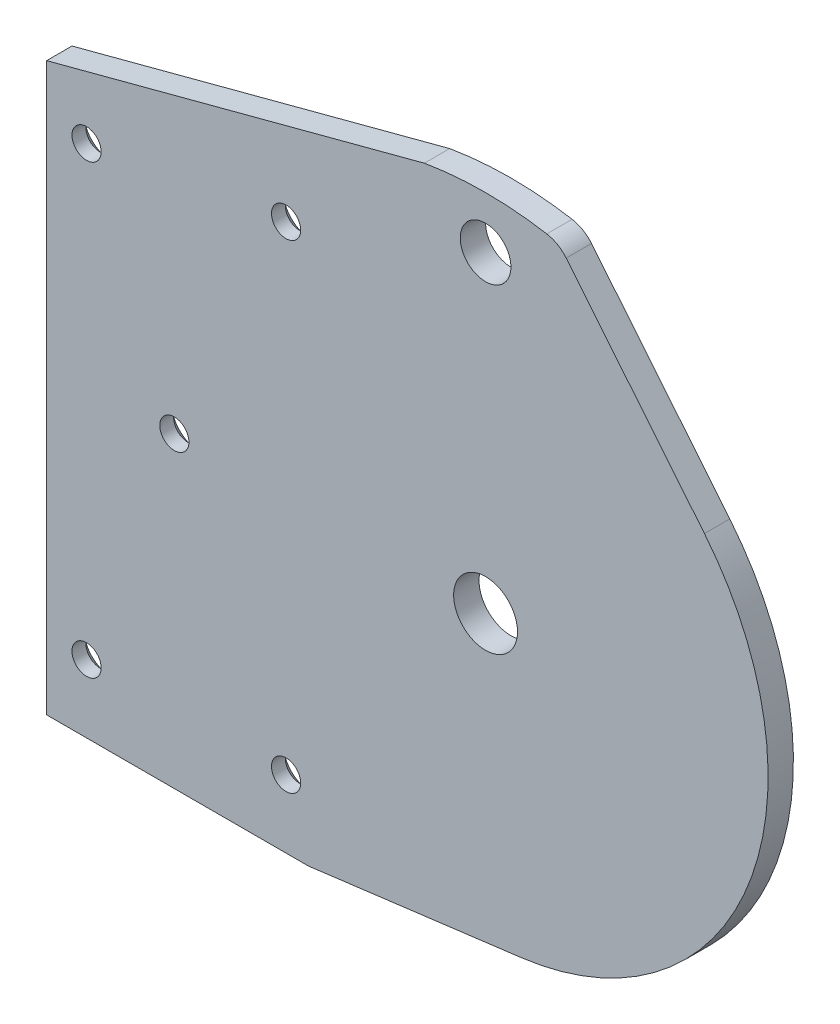
ISO-10303-21;
HEADER;
FILE_DESCRIPTION(('STEP AP214'),'2;1');
FILE_NAME('part.step','',(''),(''),'','','');
FILE_SCHEMA(('AUTOMOTIVE_DESIGN { 1 0 10303 214 1 1 1 1 }'));
ENDSEC;
DATA;
#1=APPLICATION_CONTEXT('core data for automotive mechanical design processes');
#2=APPLICATION_PROTOCOL_DEFINITION('international standard','automotive_design',2000,#1);
#3=PRODUCT_CONTEXT('',#1,'mechanical');
#4=PRODUCT('Part','Part','',(#3));
#5=PRODUCT_RELATED_PRODUCT_CATEGORY('part','',(#4));
#6=PRODUCT_DEFINITION_FORMATION('','',#4);
#7=PRODUCT_DEFINITION_CONTEXT('part definition',#1,'design');
#8=PRODUCT_DEFINITION('design','',#6,#7);
#9=PRODUCT_DEFINITION_SHAPE('','',#8);
#10=(LENGTH_UNIT() NAMED_UNIT(*) SI_UNIT(.MILLI.,.METRE.));
#11=(NAMED_UNIT(*) PLANE_ANGLE_UNIT() SI_UNIT($,.RADIAN.));
#12=(NAMED_UNIT(*) SI_UNIT($,.STERADIAN.) SOLID_ANGLE_UNIT());
#13=UNCERTAINTY_MEASURE_WITH_UNIT(LENGTH_MEASURE(1.E-05),#10,'distance_accuracy_value','');
#14=(GEOMETRIC_REPRESENTATION_CONTEXT(3) GLOBAL_UNCERTAINTY_ASSIGNED_CONTEXT((#13)) GLOBAL_UNIT_ASSIGNED_CONTEXT((#10,
#11,#12)) REPRESENTATION_CONTEXT('',''));
#15=CARTESIAN_POINT('',(0.,0.,0.));
#16=DIRECTION('',(0.,0.,1.));
#17=DIRECTION('',(1.,0.,0.));
#18=AXIS2_PLACEMENT_3D('',#15,#16,#17);
#19=CARTESIAN_POINT('',(6.10622663543836E-13,0.,-3.175));
#20=DIRECTION('',(0.,0.,1.));
#21=DIRECTION('',(1.,0.,0.));
#22=AXIS2_PLACEMENT_3D('',#19,#20,#21);
#23=PLANE('',#22);
#24=CARTESIAN_POINT('',(-50.,25.9999999999999,-3.175));
#25=DIRECTION('',(0.,0.,-1.));
#26=DIRECTION('',(-1.,0.,0.));
#27=AXIS2_PLACEMENT_3D('',#24,#25,#26);
#28=CIRCLE('',#27,3.5433);
#29=CARTESIAN_POINT('',(-53.5433,25.9999999999999,-3.175));
#30=VERTEX_POINT('',#29);
#31=EDGE_CURVE('E330',#30,#30,#28,.T.);
#32=ORIENTED_EDGE('',*,*,#31,.F.);
#33=EDGE_LOOP('',(#32));
#34=FACE_BOUND('',#33,.T.);
#35=CARTESIAN_POINT('',(-39.,0.,-3.175));
#36=DIRECTION('',(0.,0.,-1.));
#37=DIRECTION('',(-1.,0.,0.));
#38=AXIS2_PLACEMENT_3D('',#35,#36,#37);
#39=CIRCLE('',#38,3.5433);
#40=CARTESIAN_POINT('',(-42.5433,0.,-3.175));
#41=VERTEX_POINT('',#40);
#42=EDGE_CURVE('E191',#41,#41,#39,.T.);
#43=ORIENTED_EDGE('',*,*,#42,.F.);
#44=EDGE_LOOP('',(#43));
#45=FACE_BOUND('',#44,.T.);
#46=CARTESIAN_POINT('',(-50.,-30.,-3.175));
#47=DIRECTION('',(0.,0.,-1.));
#48=DIRECTION('',(-1.,0.,0.));
#49=AXIS2_PLACEMENT_3D('',#46,#47,#48);
#50=CIRCLE('',#49,3.5433);
#51=CARTESIAN_POINT('',(-53.5433,-30.,-3.175));
#52=VERTEX_POINT('',#51);
#53=EDGE_CURVE('E184',#52,#52,#50,.T.);
#54=ORIENTED_EDGE('',*,*,#53,.F.);
#55=EDGE_LOOP('',(#54));
#56=FACE_BOUND('',#55,.T.);
#57=CARTESIAN_POINT('',(-25.,30.,-3.175));
#58=DIRECTION('',(0.,0.,-1.));
#59=DIRECTION('',(-1.,0.,0.));
#60=AXIS2_PLACEMENT_3D('',#57,#58,#59);
#61=CIRCLE('',#60,3.5433);
#62=CARTESIAN_POINT('',(-28.5433,30.,-3.175));
#63=VERTEX_POINT('',#62);
#64=EDGE_CURVE('E180',#63,#63,#61,.T.);
#65=ORIENTED_EDGE('',*,*,#64,.F.);
#66=EDGE_LOOP('',(#65));
#67=FACE_BOUND('',#66,.T.);
#68=CARTESIAN_POINT('',(7.42603891157356E-13,39.175,-3.175));
#69=DIRECTION('',(0.,0.,1.));
#70=DIRECTION('',(1.,0.,0.));
#71=AXIS2_PLACEMENT_3D('',#68,#69,#70);
#72=CIRCLE('',#71,3.17499999999995);
#73=CARTESIAN_POINT('',(3.1750000000007,39.175,-3.175));
#74=VERTEX_POINT('',#73);
#75=EDGE_CURVE('E209',#74,#74,#72,.T.);
#76=ORIENTED_EDGE('',*,*,#75,.T.);
#77=EDGE_LOOP('',(#76));
#78=FACE_BOUND('',#77,.T.);
#79=CARTESIAN_POINT('',(8.12233676475137E-13,0.,-3.175));
#80=DIRECTION('',(0.,0.,1.));
#81=DIRECTION('',(1.,0.,0.));
#82=AXIS2_PLACEMENT_3D('',#79,#80,#81);
#83=CIRCLE('',#82,4.);
#84=CARTESIAN_POINT('',(4.00000000000081,0.,-3.175));
#85=VERTEX_POINT('',#84);
#86=EDGE_CURVE('E140',#85,#85,#83,.T.);
#87=ORIENTED_EDGE('',*,*,#86,.T.);
#88=EDGE_LOOP('',(#87));
#89=FACE_BOUND('',#88,.T.);
#90=CARTESIAN_POINT('',(6.10622663543836E-13,0.,-3.175));
#91=DIRECTION('',(0.,0.,1.));
#92=DIRECTION('',(1.,0.,0.));
#93=AXIS2_PLACEMENT_3D('',#90,#91,#92);
#94=CIRCLE('',#93,35.4000000000001);
#95=CARTESIAN_POINT('',(4.46793638445698,-35.1169125132671,-3.175));
#96=VERTEX_POINT('',#95);
#97=CARTESIAN_POINT('',(27.4250454842921,22.3836297365854,-3.175));
#98=VERTEX_POINT('',#97);
#99=EDGE_CURVE('E157',#96,#98,#94,.T.);
#100=ORIENTED_EDGE('',*,*,#99,.F.);
#101=DIRECTION('',(0.992003178340877,0.12621289221628,0.));
#102=VECTOR('',#101,1.);
#103=CARTESIAN_POINT('',(-22.1991036835156,-38.5097688340053,-3.175));
#104=LINE('',#103,#102);
#105=CARTESIAN_POINT('',(-22.1991036835156,-38.5097688340053,-3.175));
#106=VERTEX_POINT('',#105);
#107=EDGE_CURVE('E126',#106,#96,#104,.T.);
#108=ORIENTED_EDGE('',*,*,#107,.F.);
#109=DIRECTION('',(1.,0.,0.));
#110=VECTOR('',#109,1.);
#111=CARTESIAN_POINT('',(-54.9999999999992,-38.5097688340053,-3.175));
#112=LINE('',#111,#110);
#113=CARTESIAN_POINT('',(-54.9999999999992,-38.5097688340053,-3.175));
#114=VERTEX_POINT('',#113);
#115=EDGE_CURVE('E111',#114,#106,#112,.T.);
#116=ORIENTED_EDGE('',*,*,#115,.F.);
#117=DIRECTION('',(0.,-1.,0.));
#118=VECTOR('',#117,1.);
#119=CARTESIAN_POINT('',(-54.9999999999992,32.4911745118719,-3.175));
#120=LINE('',#119,#118);
#121=CARTESIAN_POINT('',(-54.9999999999992,32.4911745118719,-3.175));
#122=VERTEX_POINT('',#121);
#123=EDGE_CURVE('E124',#122,#114,#120,.T.);
#124=ORIENTED_EDGE('',*,*,#123,.F.);
#125=DIRECTION('',(-0.966670495847246,-0.256023734170176,0.));
#126=VECTOR('',#125,1.);
#127=CARTESIAN_POINT('',(-54.9999999999992,32.4911745118719,-3.175));
#128=LINE('',#127,#126);
#129=CARTESIAN_POINT('',(-7.67186562687424,45.026082472309,-3.175));
#130=VERTEX_POINT('',#129);
#131=EDGE_CURVE('E129',#130,#122,#128,.T.);
#132=ORIENTED_EDGE('',*,*,#131,.F.);
#133=CARTESIAN_POINT('',(8.12233676475137E-13,0.,-3.175));
#134=DIRECTION('',(0.,0.,1.));
#135=DIRECTION('',(1.,0.,0.));
#136=AXIS2_PLACEMENT_3D('',#133,#134,#135);
#137=CIRCLE('',#136,45.675);
#138=CARTESIAN_POINT('',(7.67186562687542,45.0260824723091,-3.175));
#139=VERTEX_POINT('',#138);
#140=EDGE_CURVE('E131',#139,#130,#137,.T.);
#141=ORIENTED_EDGE('',*,*,#140,.F.);
#142=CARTESIAN_POINT('',(7.0000000000008,41.0829115935081,-3.175));
#143=DIRECTION('',(0.,0.,1.));
#144=DIRECTION('',(1.,0.,0.));
#145=AXIS2_PLACEMENT_3D('',#142,#143,#144);
#146=CIRCLE('',#145,4.);
#147=CARTESIAN_POINT('',(10.0988751959659,43.6121352925573,-3.175));
#148=VERTEX_POINT('',#147);
#149=EDGE_CURVE('E222',#148,#139,#146,.T.);
#150=ORIENTED_EDGE('',*,*,#149,.F.);
#151=DIRECTION('',(-0.632305924762302,0.774718798991279,0.));
#152=VECTOR('',#151,1.);
#153=CARTESIAN_POINT('',(10.0988751959659,43.6121352925573,-3.175));
#154=LINE('',#153,#152);
#155=EDGE_CURVE('E220',#98,#148,#154,.T.);
#156=ORIENTED_EDGE('',*,*,#155,.F.);
#157=EDGE_LOOP('',(#100,#108,#116,#124,#132,#141,#150,#156));
#158=FACE_BOUND('',#157,.T.);
#159=CARTESIAN_POINT('',(-25.,-30.,-3.175));
#160=DIRECTION('',(0.,0.,-1.));
#161=DIRECTION('',(-1.,0.,0.));
#162=AXIS2_PLACEMENT_3D('',#159,#160,#161);
#163=CIRCLE('',#162,3.5433);
#164=CARTESIAN_POINT('',(-28.5433,-30.,-3.175));
#165=VERTEX_POINT('',#164);
#166=EDGE_CURVE('E176',#165,#165,#163,.T.);
#167=ORIENTED_EDGE('',*,*,#166,.F.);
#168=EDGE_LOOP('',(#167));
#169=FACE_BOUND('',#168,.T.);
#170=ADVANCED_FACE('F37',(#34,#45,#56,#67,#78,#89,#158,#169),#23,.F.);
#171=CARTESIAN_POINT('',(6.10622663543836E-13,0.,-3.175));
#172=DIRECTION('',(0.,0.,1.));
#173=DIRECTION('',(1.,0.,0.));
#174=AXIS2_PLACEMENT_3D('',#171,#172,#173);
#175=CYLINDRICAL_SURFACE('',#174,35.4000000000001);
#176=CARTESIAN_POINT('',(6.10622663543836E-13,0.,0.));
#177=DIRECTION('',(0.,0.,1.));
#178=DIRECTION('',(1.,0.,0.));
#179=AXIS2_PLACEMENT_3D('',#176,#177,#178);
#180=CIRCLE('',#179,35.4000000000001);
#181=CARTESIAN_POINT('',(4.46793638445698,-35.1169125132671,0.));
#182=VERTEX_POINT('',#181);
#183=CARTESIAN_POINT('',(27.4250454842921,22.3836297365854,0.));
#184=VERTEX_POINT('',#183);
#185=EDGE_CURVE('E136',#182,#184,#180,.T.);
#186=ORIENTED_EDGE('',*,*,#185,.F.);
#187=DIRECTION('',(0.,0.,1.));
#188=VECTOR('',#187,1.);
#189=CARTESIAN_POINT('',(4.46793638445698,-35.1169125132671,-3.175));
#190=LINE('',#189,#188);
#191=EDGE_CURVE('E11',#96,#182,#190,.T.);
#192=ORIENTED_EDGE('',*,*,#191,.F.);
#193=ORIENTED_EDGE('',*,*,#99,.T.);
#194=DIRECTION('',(0.,0.,1.));
#195=VECTOR('',#194,1.);
#196=CARTESIAN_POINT('',(27.4250454842921,22.3836297365854,-3.175));
#197=LINE('',#196,#195);
#198=EDGE_CURVE('E94',#98,#184,#197,.T.);
#199=ORIENTED_EDGE('',*,*,#198,.T.);
#200=EDGE_LOOP('',(#186,#192,#193,#199));
#201=FACE_BOUND('',#200,.T.);
#202=ADVANCED_FACE('F39',(#201),#175,.T.);
#203=CARTESIAN_POINT('',(-22.1991036835156,-38.5097688340053,-3.175));
#204=DIRECTION('',(0.12621289221628,-0.992003178340877,0.));
#205=DIRECTION('',(0.992003178340877,0.12621289221628,0.));
#206=AXIS2_PLACEMENT_3D('',#203,#204,#205);
#207=PLANE('',#206);
#208=DIRECTION('',(0.992003178340877,0.12621289221628,0.));
#209=VECTOR('',#208,1.);
#210=CARTESIAN_POINT('',(-22.1991036835156,-38.5097688340053,0.));
#211=LINE('',#210,#209);
#212=CARTESIAN_POINT('',(-22.1991036835156,-38.5097688340053,0.));
#213=VERTEX_POINT('',#212);
#214=EDGE_CURVE('E155',#213,#182,#211,.T.);
#215=ORIENTED_EDGE('',*,*,#214,.F.);
#216=DIRECTION('',(0.,0.,1.));
#217=VECTOR('',#216,1.);
#218=CARTESIAN_POINT('',(-22.1991036835156,-38.5097688340053,-3.175));
#219=LINE('',#218,#217);
#220=EDGE_CURVE('E47',#106,#213,#219,.T.);
#221=ORIENTED_EDGE('',*,*,#220,.F.);
#222=ORIENTED_EDGE('',*,*,#107,.T.);
#223=ORIENTED_EDGE('',*,*,#191,.T.);
#224=EDGE_LOOP('',(#215,#221,#222,#223));
#225=FACE_BOUND('',#224,.T.);
#226=ADVANCED_FACE('F237',(#225),#207,.T.);
#227=CARTESIAN_POINT('',(-54.9999999999992,-38.5097688340053,-3.175));
#228=DIRECTION('',(0.,-1.,0.));
#229=DIRECTION('',(1.,0.,0.));
#230=AXIS2_PLACEMENT_3D('',#227,#228,#229);
#231=PLANE('',#230);
#232=DIRECTION('',(1.,0.,0.));
#233=VECTOR('',#232,1.);
#234=CARTESIAN_POINT('',(-54.9999999999992,-38.5097688340053,0.));
#235=LINE('',#234,#233);
#236=CARTESIAN_POINT('',(-54.9999999999992,-38.5097688340053,0.));
#237=VERTEX_POINT('',#236);
#238=EDGE_CURVE('E113',#237,#213,#235,.T.);
#239=ORIENTED_EDGE('',*,*,#238,.F.);
#240=DIRECTION('',(0.,0.,1.));
#241=VECTOR('',#240,1.);
#242=CARTESIAN_POINT('',(-54.9999999999992,-38.5097688340053,-3.175));
#243=LINE('',#242,#241);
#244=EDGE_CURVE('E108',#114,#237,#243,.T.);
#245=ORIENTED_EDGE('',*,*,#244,.F.);
#246=ORIENTED_EDGE('',*,*,#115,.T.);
#247=ORIENTED_EDGE('',*,*,#220,.T.);
#248=EDGE_LOOP('',(#239,#245,#246,#247));
#249=FACE_BOUND('',#248,.T.);
#250=ADVANCED_FACE('F110',(#249),#231,.T.);
#251=CARTESIAN_POINT('',(-54.9999999999992,32.4911745118719,-3.175));
#252=DIRECTION('',(-1.,0.,0.));
#253=DIRECTION('',(0.,-1.,0.));
#254=AXIS2_PLACEMENT_3D('',#251,#252,#253);
#255=PLANE('',#254);
#256=DIRECTION('',(0.,-1.,0.));
#257=VECTOR('',#256,1.);
#258=CARTESIAN_POINT('',(-54.9999999999992,32.4911745118719,0.));
#259=LINE('',#258,#257);
#260=CARTESIAN_POINT('',(-54.9999999999992,32.4911745118719,0.));
#261=VERTEX_POINT('',#260);
#262=EDGE_CURVE('E152',#261,#237,#259,.T.);
#263=ORIENTED_EDGE('',*,*,#262,.F.);
#264=DIRECTION('',(0.,0.,1.));
#265=VECTOR('',#264,1.);
#266=CARTESIAN_POINT('',(-54.9999999999992,32.4911745118719,-3.175));
#267=LINE('',#266,#265);
#268=EDGE_CURVE('E118',#122,#261,#267,.T.);
#269=ORIENTED_EDGE('',*,*,#268,.F.);
#270=ORIENTED_EDGE('',*,*,#123,.T.);
#271=ORIENTED_EDGE('',*,*,#244,.T.);
#272=EDGE_LOOP('',(#263,#269,#270,#271));
#273=FACE_BOUND('',#272,.T.);
#274=ADVANCED_FACE('F128',(#273),#255,.T.);
#275=CARTESIAN_POINT('',(-54.9999999999992,32.4911745118719,-3.175));
#276=DIRECTION('',(-0.256023734170175,0.966670495847245,0.));
#277=DIRECTION('',(-0.966670495847246,-0.256023734170176,0.));
#278=AXIS2_PLACEMENT_3D('',#275,#276,#277);
#279=PLANE('',#278);
#280=DIRECTION('',(-0.966670495847246,-0.256023734170176,0.));
#281=VECTOR('',#280,1.);
#282=CARTESIAN_POINT('',(-54.9999999999992,32.4911745118719,0.));
#283=LINE('',#282,#281);
#284=CARTESIAN_POINT('',(-7.67186562687424,45.026082472309,0.));
#285=VERTEX_POINT('',#284);
#286=EDGE_CURVE('E149',#285,#261,#283,.T.);
#287=ORIENTED_EDGE('',*,*,#286,.F.);
#288=DIRECTION('',(0.,0.,1.));
#289=VECTOR('',#288,1.);
#290=CARTESIAN_POINT('',(-7.67186562687424,45.026082472309,-3.175));
#291=LINE('',#290,#289);
#292=EDGE_CURVE('E161',#130,#285,#291,.T.);
#293=ORIENTED_EDGE('',*,*,#292,.F.);
#294=ORIENTED_EDGE('',*,*,#131,.T.);
#295=ORIENTED_EDGE('',*,*,#268,.T.);
#296=EDGE_LOOP('',(#287,#293,#294,#295));
#297=FACE_BOUND('',#296,.T.);
#298=ADVANCED_FACE('F410',(#297),#279,.T.);
#299=CARTESIAN_POINT('',(8.12233676475137E-13,0.,-3.175));
#300=DIRECTION('',(0.,0.,1.));
#301=DIRECTION('',(1.,0.,0.));
#302=AXIS2_PLACEMENT_3D('',#299,#300,#301);
#303=CYLINDRICAL_SURFACE('',#302,45.675);
#304=CARTESIAN_POINT('',(8.12233676475137E-13,0.,0.));
#305=DIRECTION('',(0.,0.,1.));
#306=DIRECTION('',(1.,0.,0.));
#307=AXIS2_PLACEMENT_3D('',#304,#305,#306);
#308=CIRCLE('',#307,45.675);
#309=CARTESIAN_POINT('',(7.67186562687542,45.0260824723091,0.));
#310=VERTEX_POINT('',#309);
#311=EDGE_CURVE('E146',#310,#285,#308,.T.);
#312=ORIENTED_EDGE('',*,*,#311,.F.);
#313=DIRECTION('',(0.,0.,1.));
#314=VECTOR('',#313,1.);
#315=CARTESIAN_POINT('',(7.67186562687542,45.0260824723091,-3.175));
#316=LINE('',#315,#314);
#317=EDGE_CURVE('E163',#139,#310,#316,.T.);
#318=ORIENTED_EDGE('',*,*,#317,.F.);
#319=ORIENTED_EDGE('',*,*,#140,.T.);
#320=ORIENTED_EDGE('',*,*,#292,.T.);
#321=EDGE_LOOP('',(#312,#318,#319,#320));
#322=FACE_BOUND('',#321,.T.);
#323=ADVANCED_FACE('F228',(#322),#303,.T.);
#324=CARTESIAN_POINT('',(7.0000000000008,41.0829115935081,-3.175));
#325=DIRECTION('',(0.,0.,1.));
#326=DIRECTION('',(1.,0.,0.));
#327=AXIS2_PLACEMENT_3D('',#324,#325,#326);
#328=CYLINDRICAL_SURFACE('',#327,4.);
#329=CARTESIAN_POINT('',(7.0000000000008,41.0829115935081,0.));
#330=DIRECTION('',(0.,0.,1.));
#331=DIRECTION('',(1.,0.,0.));
#332=AXIS2_PLACEMENT_3D('',#329,#330,#331);
#333=CIRCLE('',#332,4.);
#334=CARTESIAN_POINT('',(10.0988751959659,43.6121352925573,0.));
#335=VERTEX_POINT('',#334);
#336=EDGE_CURVE('E143',#335,#310,#333,.T.);
#337=ORIENTED_EDGE('',*,*,#336,.F.);
#338=DIRECTION('',(0.,0.,1.));
#339=VECTOR('',#338,1.);
#340=CARTESIAN_POINT('',(10.0988751959659,43.6121352925573,-3.175));
#341=LINE('',#340,#339);
#342=EDGE_CURVE('E165',#148,#335,#341,.T.);
#343=ORIENTED_EDGE('',*,*,#342,.F.);
#344=ORIENTED_EDGE('',*,*,#149,.T.);
#345=ORIENTED_EDGE('',*,*,#317,.T.);
#346=EDGE_LOOP('',(#337,#343,#344,#345));
#347=FACE_BOUND('',#346,.T.);
#348=ADVANCED_FACE('F233',(#347),#328,.T.);
#349=CARTESIAN_POINT('',(10.0988751959659,43.6121352925573,-3.175));
#350=DIRECTION('',(0.774718798991279,0.632305924762302,0.));
#351=DIRECTION('',(-0.632305924762302,0.774718798991279,0.));
#352=AXIS2_PLACEMENT_3D('',#349,#350,#351);
#353=PLANE('',#352);
#354=DIRECTION('',(-0.632305924762302,0.774718798991279,0.));
#355=VECTOR('',#354,1.);
#356=CARTESIAN_POINT('',(10.0988751959659,43.6121352925573,0.));
#357=LINE('',#356,#355);
#358=EDGE_CURVE('E139',#184,#335,#357,.T.);
#359=ORIENTED_EDGE('',*,*,#358,.F.);
#360=ORIENTED_EDGE('',*,*,#198,.F.);
#361=ORIENTED_EDGE('',*,*,#155,.T.);
#362=ORIENTED_EDGE('',*,*,#342,.T.);
#363=EDGE_LOOP('',(#359,#360,#361,#362));
#364=FACE_BOUND('',#363,.T.);
#365=ADVANCED_FACE('F234',(#364),#353,.T.);
#366=CARTESIAN_POINT('',(6.10622663543836E-13,0.,0.));
#367=DIRECTION('',(0.,0.,1.));
#368=DIRECTION('',(1.,0.,0.));
#369=AXIS2_PLACEMENT_3D('',#366,#367,#368);
#370=PLANE('',#369);
#371=CARTESIAN_POINT('',(-50.,25.9999999999999,0.));
#372=DIRECTION('',(0.,0.,1.));
#373=DIRECTION('',(1.,0.,0.));
#374=AXIS2_PLACEMENT_3D('',#371,#372,#373);
#375=CIRCLE('',#374,1.82879999999999);
#376=CARTESIAN_POINT('',(-48.1712,25.9999999999999,0.));
#377=VERTEX_POINT('',#376);
#378=EDGE_CURVE('E41',#377,#377,#375,.T.);
#379=ORIENTED_EDGE('',*,*,#378,.F.);
#380=EDGE_LOOP('',(#379));
#381=FACE_BOUND('',#380,.T.);
#382=CARTESIAN_POINT('',(-39.,0.,0.));
#383=DIRECTION('',(0.,0.,1.));
#384=DIRECTION('',(1.,0.,0.));
#385=AXIS2_PLACEMENT_3D('',#382,#383,#384);
#386=CIRCLE('',#385,1.82879999999999);
#387=CARTESIAN_POINT('',(-37.1712,0.,0.));
#388=VERTEX_POINT('',#387);
#389=EDGE_CURVE('E182',#388,#388,#386,.T.);
#390=ORIENTED_EDGE('',*,*,#389,.F.);
#391=EDGE_LOOP('',(#390));
#392=FACE_BOUND('',#391,.T.);
#393=CARTESIAN_POINT('',(-50.,-30.,0.));
#394=DIRECTION('',(0.,0.,1.));
#395=DIRECTION('',(1.,0.,0.));
#396=AXIS2_PLACEMENT_3D('',#393,#394,#395);
#397=CIRCLE('',#396,1.82879999999999);
#398=CARTESIAN_POINT('',(-48.1712,-30.,0.));
#399=VERTEX_POINT('',#398);
#400=EDGE_CURVE('E178',#399,#399,#397,.T.);
#401=ORIENTED_EDGE('',*,*,#400,.F.);
#402=EDGE_LOOP('',(#401));
#403=FACE_BOUND('',#402,.T.);
#404=CARTESIAN_POINT('',(-25.,30.,0.));
#405=DIRECTION('',(0.,0.,1.));
#406=DIRECTION('',(1.,0.,0.));
#407=AXIS2_PLACEMENT_3D('',#404,#405,#406);
#408=CIRCLE('',#407,1.82879999999999);
#409=CARTESIAN_POINT('',(-23.1712,30.,0.));
#410=VERTEX_POINT('',#409);
#411=EDGE_CURVE('E173',#410,#410,#408,.T.);
#412=ORIENTED_EDGE('',*,*,#411,.F.);
#413=EDGE_LOOP('',(#412));
#414=FACE_BOUND('',#413,.T.);
#415=CARTESIAN_POINT('',(-25.,-30.,0.));
#416=DIRECTION('',(0.,0.,1.));
#417=DIRECTION('',(1.,0.,0.));
#418=AXIS2_PLACEMENT_3D('',#415,#416,#417);
#419=CIRCLE('',#418,1.82879999999999);
#420=CARTESIAN_POINT('',(-23.1712,-30.,0.));
#421=VERTEX_POINT('',#420);
#422=EDGE_CURVE('E168',#421,#421,#419,.T.);
#423=ORIENTED_EDGE('',*,*,#422,.F.);
#424=EDGE_LOOP('',(#423));
#425=FACE_BOUND('',#424,.T.);
#426=CARTESIAN_POINT('',(7.42603891157356E-13,39.175,0.));
#427=DIRECTION('',(0.,0.,1.));
#428=DIRECTION('',(1.,0.,0.));
#429=AXIS2_PLACEMENT_3D('',#426,#427,#428);
#430=CIRCLE('',#429,3.17499999999995);
#431=CARTESIAN_POINT('',(3.1750000000007,39.175,0.));
#432=VERTEX_POINT('',#431);
#433=EDGE_CURVE('E171',#432,#432,#430,.T.);
#434=ORIENTED_EDGE('',*,*,#433,.F.);
#435=EDGE_LOOP('',(#434));
#436=FACE_BOUND('',#435,.T.);
#437=CARTESIAN_POINT('',(8.12233676475137E-13,0.,0.));
#438=DIRECTION('',(0.,0.,1.));
#439=DIRECTION('',(1.,0.,0.));
#440=AXIS2_PLACEMENT_3D('',#437,#438,#439);
#441=CIRCLE('',#440,4.);
#442=CARTESIAN_POINT('',(4.00000000000081,0.,0.));
#443=VERTEX_POINT('',#442);
#444=EDGE_CURVE('E212',#443,#443,#441,.T.);
#445=ORIENTED_EDGE('',*,*,#444,.F.);
#446=EDGE_LOOP('',(#445));
#447=FACE_BOUND('',#446,.T.);
#448=ORIENTED_EDGE('',*,*,#185,.T.);
#449=ORIENTED_EDGE('',*,*,#358,.T.);
#450=ORIENTED_EDGE('',*,*,#336,.T.);
#451=ORIENTED_EDGE('',*,*,#311,.T.);
#452=ORIENTED_EDGE('',*,*,#286,.T.);
#453=ORIENTED_EDGE('',*,*,#262,.T.);
#454=ORIENTED_EDGE('',*,*,#238,.T.);
#455=ORIENTED_EDGE('',*,*,#214,.T.);
#456=EDGE_LOOP('',(#448,#449,#450,#451,#452,#453,#454,#455));
#457=FACE_BOUND('',#456,.T.);
#458=ADVANCED_FACE('F236',(#381,#392,#403,#414,#425,#436,#447,#457),#370,.T.);
#459=CARTESIAN_POINT('',(8.12233676475137E-13,0.,-3.175));
#460=DIRECTION('',(0.,0.,1.));
#461=DIRECTION('',(1.,0.,0.));
#462=AXIS2_PLACEMENT_3D('',#459,#460,#461);
#463=CYLINDRICAL_SURFACE('',#462,4.);
#464=ORIENTED_EDGE('',*,*,#86,.F.);
#465=EDGE_LOOP('',(#464));
#466=FACE_BOUND('',#465,.T.);
#467=ORIENTED_EDGE('',*,*,#444,.T.);
#468=EDGE_LOOP('',(#467));
#469=FACE_BOUND('',#468,.T.);
#470=ADVANCED_FACE('F254',(#466,#469),#463,.F.);
#471=CARTESIAN_POINT('',(7.42603891157356E-13,39.175,-3.175));
#472=DIRECTION('',(0.,0.,1.));
#473=DIRECTION('',(1.,0.,0.));
#474=AXIS2_PLACEMENT_3D('',#471,#472,#473);
#475=CYLINDRICAL_SURFACE('',#474,3.17499999999995);
#476=ORIENTED_EDGE('',*,*,#75,.F.);
#477=EDGE_LOOP('',(#476));
#478=FACE_BOUND('',#477,.T.);
#479=ORIENTED_EDGE('',*,*,#433,.T.);
#480=EDGE_LOOP('',(#479));
#481=FACE_BOUND('',#480,.T.);
#482=ADVANCED_FACE('F262',(#478,#481),#475,.F.);
#483=CARTESIAN_POINT('',(-25.,-30.,-3.175));
#484=DIRECTION('',(0.,0.,-1.));
#485=DIRECTION('',(-1.,0.,0.));
#486=AXIS2_PLACEMENT_3D('',#483,#484,#485);
#487=CYLINDRICAL_SURFACE('',#486,1.82879999999999);
#488=ORIENTED_EDGE('',*,*,#422,.T.);
#489=EDGE_LOOP('',(#488));
#490=FACE_BOUND('',#489,.T.);
#491=CARTESIAN_POINT('',(-25.,-30.,-1.73636368234655));
#492=DIRECTION('',(0.,0.,-1.));
#493=DIRECTION('',(-1.,0.,0.));
#494=AXIS2_PLACEMENT_3D('',#491,#492,#493);
#495=CIRCLE('',#494,1.8288);
#496=CARTESIAN_POINT('',(-26.8288,-30.,-1.73636368234655));
#497=VERTEX_POINT('',#496);
#498=EDGE_CURVE('E172',#497,#497,#495,.T.);
#499=ORIENTED_EDGE('',*,*,#498,.T.);
#500=EDGE_LOOP('',(#499));
#501=FACE_BOUND('',#500,.T.);
#502=ADVANCED_FACE('F280',(#490,#501),#487,.F.);
#503=CARTESIAN_POINT('',(-25.,-30.,-3.175));
#504=DIRECTION('',(0.,0.,-1.));
#505=DIRECTION('',(-1.,0.,0.));
#506=AXIS2_PLACEMENT_3D('',#503,#504,#505);
#507=CONICAL_SURFACE('',#506,3.5433,0.872664625997164);
#508=ORIENTED_EDGE('',*,*,#498,.F.);
#509=EDGE_LOOP('',(#508));
#510=FACE_BOUND('',#509,.T.);
#511=ORIENTED_EDGE('',*,*,#166,.T.);
#512=EDGE_LOOP('',(#511));
#513=FACE_BOUND('',#512,.T.);
#514=ADVANCED_FACE('F285',(#510,#513),#507,.F.);
#515=CARTESIAN_POINT('',(-25.,30.,-3.175));
#516=DIRECTION('',(0.,0.,-1.));
#517=DIRECTION('',(-1.,0.,0.));
#518=AXIS2_PLACEMENT_3D('',#515,#516,#517);
#519=CYLINDRICAL_SURFACE('',#518,1.82879999999999);
#520=ORIENTED_EDGE('',*,*,#411,.T.);
#521=EDGE_LOOP('',(#520));
#522=FACE_BOUND('',#521,.T.);
#523=CARTESIAN_POINT('',(-25.,30.,-1.73636368234655));
#524=DIRECTION('',(0.,0.,-1.));
#525=DIRECTION('',(-1.,0.,0.));
#526=AXIS2_PLACEMENT_3D('',#523,#524,#525);
#527=CIRCLE('',#526,1.8288);
#528=CARTESIAN_POINT('',(-26.8288,30.,-1.73636368234655));
#529=VERTEX_POINT('',#528);
#530=EDGE_CURVE('E177',#529,#529,#527,.T.);
#531=ORIENTED_EDGE('',*,*,#530,.T.);
#532=EDGE_LOOP('',(#531));
#533=FACE_BOUND('',#532,.T.);
#534=ADVANCED_FACE('F292',(#522,#533),#519,.F.);
#535=CARTESIAN_POINT('',(-25.,30.,-3.175));
#536=DIRECTION('',(0.,0.,-1.));
#537=DIRECTION('',(-1.,0.,0.));
#538=AXIS2_PLACEMENT_3D('',#535,#536,#537);
#539=CONICAL_SURFACE('',#538,3.5433,0.872664625997164);
#540=ORIENTED_EDGE('',*,*,#530,.F.);
#541=EDGE_LOOP('',(#540));
#542=FACE_BOUND('',#541,.T.);
#543=ORIENTED_EDGE('',*,*,#64,.T.);
#544=EDGE_LOOP('',(#543));
#545=FACE_BOUND('',#544,.T.);
#546=ADVANCED_FACE('F296',(#542,#545),#539,.F.);
#547=CARTESIAN_POINT('',(-50.,-30.,-3.175));
#548=DIRECTION('',(0.,0.,-1.));
#549=DIRECTION('',(-1.,0.,0.));
#550=AXIS2_PLACEMENT_3D('',#547,#548,#549);
#551=CYLINDRICAL_SURFACE('',#550,1.82879999999999);
#552=ORIENTED_EDGE('',*,*,#400,.T.);
#553=EDGE_LOOP('',(#552));
#554=FACE_BOUND('',#553,.T.);
#555=CARTESIAN_POINT('',(-50.,-30.,-1.73636368234655));
#556=DIRECTION('',(0.,0.,-1.));
#557=DIRECTION('',(-1.,0.,0.));
#558=AXIS2_PLACEMENT_3D('',#555,#556,#557);
#559=CIRCLE('',#558,1.8288);
#560=CARTESIAN_POINT('',(-51.8288,-30.,-1.73636368234655));
#561=VERTEX_POINT('',#560);
#562=EDGE_CURVE('E181',#561,#561,#559,.T.);
#563=ORIENTED_EDGE('',*,*,#562,.T.);
#564=EDGE_LOOP('',(#563));
#565=FACE_BOUND('',#564,.T.);
#566=ADVANCED_FACE('F300',(#554,#565),#551,.F.);
#567=CARTESIAN_POINT('',(-50.,-30.,-3.175));
#568=DIRECTION('',(0.,0.,-1.));
#569=DIRECTION('',(-1.,0.,0.));
#570=AXIS2_PLACEMENT_3D('',#567,#568,#569);
#571=CONICAL_SURFACE('',#570,3.5433,0.872664625997164);
#572=ORIENTED_EDGE('',*,*,#562,.F.);
#573=EDGE_LOOP('',(#572));
#574=FACE_BOUND('',#573,.T.);
#575=ORIENTED_EDGE('',*,*,#53,.T.);
#576=EDGE_LOOP('',(#575));
#577=FACE_BOUND('',#576,.T.);
#578=ADVANCED_FACE('F304',(#574,#577),#571,.F.);
#579=CARTESIAN_POINT('',(-39.,0.,-3.175));
#580=DIRECTION('',(0.,0.,-1.));
#581=DIRECTION('',(-1.,0.,0.));
#582=AXIS2_PLACEMENT_3D('',#579,#580,#581);
#583=CYLINDRICAL_SURFACE('',#582,1.82879999999999);
#584=ORIENTED_EDGE('',*,*,#389,.T.);
#585=EDGE_LOOP('',(#584));
#586=FACE_BOUND('',#585,.T.);
#587=CARTESIAN_POINT('',(-39.,0.,-1.73636368234655));
#588=DIRECTION('',(0.,0.,-1.));
#589=DIRECTION('',(-1.,0.,0.));
#590=AXIS2_PLACEMENT_3D('',#587,#588,#589);
#591=CIRCLE('',#590,1.8288);
#592=CARTESIAN_POINT('',(-40.8288,0.,-1.73636368234655));
#593=VERTEX_POINT('',#592);
#594=EDGE_CURVE('E185',#593,#593,#591,.T.);
#595=ORIENTED_EDGE('',*,*,#594,.T.);
#596=EDGE_LOOP('',(#595));
#597=FACE_BOUND('',#596,.T.);
#598=ADVANCED_FACE('F308',(#586,#597),#583,.F.);
#599=CARTESIAN_POINT('',(-39.,0.,-3.175));
#600=DIRECTION('',(0.,0.,-1.));
#601=DIRECTION('',(-1.,0.,0.));
#602=AXIS2_PLACEMENT_3D('',#599,#600,#601);
#603=CONICAL_SURFACE('',#602,3.5433,0.872664625997164);
#604=ORIENTED_EDGE('',*,*,#594,.F.);
#605=EDGE_LOOP('',(#604));
#606=FACE_BOUND('',#605,.T.);
#607=ORIENTED_EDGE('',*,*,#42,.T.);
#608=EDGE_LOOP('',(#607));
#609=FACE_BOUND('',#608,.T.);
#610=ADVANCED_FACE('F312',(#606,#609),#603,.F.);
#611=CARTESIAN_POINT('',(-50.,25.9999999999999,-3.175));
#612=DIRECTION('',(0.,0.,-1.));
#613=DIRECTION('',(-1.,0.,0.));
#614=AXIS2_PLACEMENT_3D('',#611,#612,#613);
#615=CYLINDRICAL_SURFACE('',#614,1.82879999999999);
#616=ORIENTED_EDGE('',*,*,#378,.T.);
#617=EDGE_LOOP('',(#616));
#618=FACE_BOUND('',#617,.T.);
#619=CARTESIAN_POINT('',(-50.,25.9999999999999,-1.73636368234655));
#620=DIRECTION('',(0.,0.,-1.));
#621=DIRECTION('',(-1.,0.,0.));
#622=AXIS2_PLACEMENT_3D('',#619,#620,#621);
#623=CIRCLE('',#622,1.8288);
#624=CARTESIAN_POINT('',(-51.8288,25.9999999999999,-1.73636368234655));
#625=VERTEX_POINT('',#624);
#626=EDGE_CURVE('E328',#625,#625,#623,.T.);
#627=ORIENTED_EDGE('',*,*,#626,.T.);
#628=EDGE_LOOP('',(#627));
#629=FACE_BOUND('',#628,.T.);
#630=ADVANCED_FACE('F315',(#618,#629),#615,.F.);
#631=CARTESIAN_POINT('',(-50.,25.9999999999999,-3.175));
#632=DIRECTION('',(0.,0.,-1.));
#633=DIRECTION('',(-1.,0.,0.));
#634=AXIS2_PLACEMENT_3D('',#631,#632,#633);
#635=CONICAL_SURFACE('',#634,3.5433,0.872664625997164);
#636=ORIENTED_EDGE('',*,*,#626,.F.);
#637=EDGE_LOOP('',(#636));
#638=FACE_BOUND('',#637,.T.);
#639=ORIENTED_EDGE('',*,*,#31,.T.);
#640=EDGE_LOOP('',(#639));
#641=FACE_BOUND('',#640,.T.);
#642=ADVANCED_FACE('F319',(#638,#641),#635,.F.);
#643=CLOSED_SHELL('',(#170,#202,#226,#250,#274,#298,#323,#348,#365,#458,#470,#482,#502,#514,
#534,#546,#566,#578,#598,#610,#630,#642));
#644=MANIFOLD_SOLID_BREP('B2',#643);
#645=ADVANCED_BREP_SHAPE_REPRESENTATION('',(#18,#644),#14);
#646=SHAPE_DEFINITION_REPRESENTATION(#9,#645);
ENDSEC;
END-ISO-10303-21;
